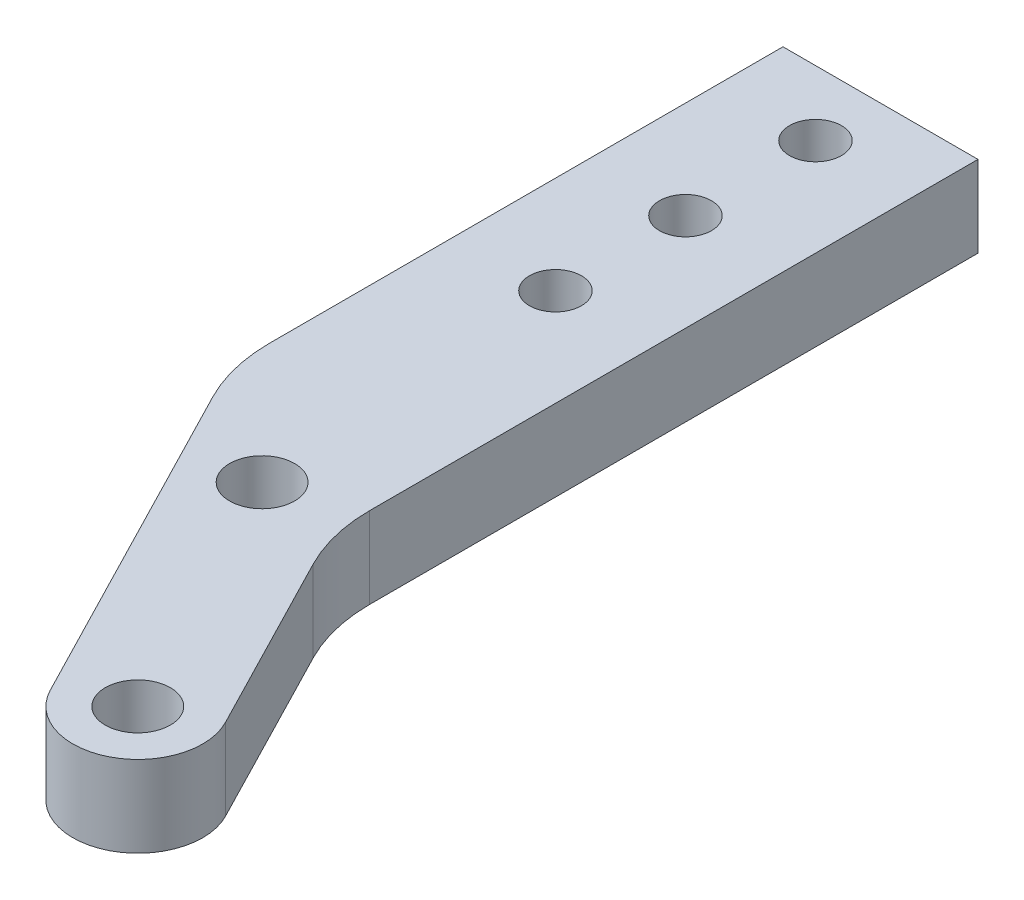
ISO-10303-21;
HEADER;
FILE_DESCRIPTION(('STEP AP214'),'2;1');
FILE_NAME('part.step','',(''),(''),'','','');
FILE_SCHEMA(('AUTOMOTIVE_DESIGN { 1 0 10303 214 1 1 1 1 }'));
ENDSEC;
DATA;
#1=APPLICATION_CONTEXT('core data for automotive mechanical design processes');
#2=APPLICATION_PROTOCOL_DEFINITION('international standard','automotive_design',2000,#1);
#3=PRODUCT_CONTEXT('',#1,'mechanical');
#4=PRODUCT('Part','Part','',(#3));
#5=PRODUCT_RELATED_PRODUCT_CATEGORY('part','',(#4));
#6=PRODUCT_DEFINITION_FORMATION('','',#4);
#7=PRODUCT_DEFINITION_CONTEXT('part definition',#1,'design');
#8=PRODUCT_DEFINITION('design','',#6,#7);
#9=PRODUCT_DEFINITION_SHAPE('','',#8);
#10=(LENGTH_UNIT() NAMED_UNIT(*) SI_UNIT(.MILLI.,.METRE.));
#11=(NAMED_UNIT(*) PLANE_ANGLE_UNIT() SI_UNIT($,.RADIAN.));
#12=(NAMED_UNIT(*) SI_UNIT($,.STERADIAN.) SOLID_ANGLE_UNIT());
#13=UNCERTAINTY_MEASURE_WITH_UNIT(LENGTH_MEASURE(1.E-05),#10,'distance_accuracy_value','');
#14=(GEOMETRIC_REPRESENTATION_CONTEXT(3) GLOBAL_UNCERTAINTY_ASSIGNED_CONTEXT((#13)) GLOBAL_UNIT_ASSIGNED_CONTEXT((#10,
#11,#12)) REPRESENTATION_CONTEXT('',''));
#15=CARTESIAN_POINT('',(0.,0.,0.));
#16=DIRECTION('',(0.,0.,1.));
#17=DIRECTION('',(1.,0.,0.));
#18=AXIS2_PLACEMENT_3D('',#15,#16,#17);
#19=CARTESIAN_POINT('',(4.00000000017351,5.,31.6132614791281));
#20=DIRECTION('',(0.,-1.,0.));
#21=DIRECTION('',(0.,0.,-1.));
#22=AXIS2_PLACEMENT_3D('',#19,#20,#21);
#23=CYLINDRICAL_SURFACE('',#22,10.0000000004375);
#24=CARTESIAN_POINT('',(4.00000000017351,0.,31.6132614791281));
#25=DIRECTION('',(0.,-1.,0.));
#26=DIRECTION('',(0.,0.,-1.));
#27=AXIS2_PLACEMENT_3D('',#24,#25,#26);
#28=CIRCLE('',#27,10.0000000004375);
#29=CARTESIAN_POINT('',(-4.88937213881033,0.,36.1935521886143));
#30=VERTEX_POINT('',#29);
#31=CARTESIAN_POINT('',(-6.00000000026409,0.,31.6132614791279));
#32=VERTEX_POINT('',#31);
#33=EDGE_CURVE('E131',#30,#32,#28,.T.);
#34=ORIENTED_EDGE('',*,*,#33,.F.);
#35=DIRECTION('',(0.,-1.,0.));
#36=VECTOR('',#35,1.);
#37=CARTESIAN_POINT('',(-4.88937213881033,5.,36.1935521886143));
#38=LINE('',#37,#36);
#39=CARTESIAN_POINT('',(-4.88937213881033,5.,36.1935521886143));
#40=VERTEX_POINT('',#39);
#41=EDGE_CURVE('E11',#40,#30,#38,.T.);
#42=ORIENTED_EDGE('',*,*,#41,.F.);
#43=CARTESIAN_POINT('',(4.00000000017351,5.,31.6132614791281));
#44=DIRECTION('',(0.,-1.,0.));
#45=DIRECTION('',(0.,0.,-1.));
#46=AXIS2_PLACEMENT_3D('',#43,#44,#45);
#47=CIRCLE('',#46,10.0000000004375);
#48=CARTESIAN_POINT('',(-6.00000000026409,5.,31.6132614791279));
#49=VERTEX_POINT('',#48);
#50=EDGE_CURVE('E152',#40,#49,#47,.T.);
#51=ORIENTED_EDGE('',*,*,#50,.T.);
#52=DIRECTION('',(0.,-1.,0.));
#53=VECTOR('',#52,1.);
#54=CARTESIAN_POINT('',(-6.00000000026409,5.,31.6132614791279));
#55=LINE('',#54,#53);
#56=EDGE_CURVE('E37',#49,#32,#55,.T.);
#57=ORIENTED_EDGE('',*,*,#56,.T.);
#58=EDGE_LOOP('',(#34,#42,#51,#57));
#59=FACE_BOUND('',#58,.T.);
#60=ADVANCED_FACE('F34',(#59),#23,.T.);
#61=CARTESIAN_POINT('',(5.74474486111336,5.,56.8321162836911));
#62=DIRECTION('',(-0.888937213859502,0.,0.458029070928589));
#63=DIRECTION('',(0.458029070928589,0.,0.888937213859502));
#64=AXIS2_PLACEMENT_3D('',#61,#62,#63);
#65=PLANE('',#64);
#66=DIRECTION('',(-0.458029070928589,0.,-0.888937213859502));
#67=VECTOR('',#66,1.);
#68=CARTESIAN_POINT('',(5.74474486111336,0.,56.8321162836911));
#69=LINE('',#68,#67);
#70=CARTESIAN_POINT('',(5.74474486111336,0.,56.8321162836911));
#71=VERTEX_POINT('',#70);
#72=EDGE_CURVE('E150',#71,#30,#69,.T.);
#73=ORIENTED_EDGE('',*,*,#72,.F.);
#74=DIRECTION('',(0.,-1.,0.));
#75=VECTOR('',#74,1.);
#76=CARTESIAN_POINT('',(5.74474486111336,5.,56.8321162836911));
#77=LINE('',#76,#75);
#78=CARTESIAN_POINT('',(5.74474486111336,5.,56.8321162836911));
#79=VERTEX_POINT('',#78);
#80=EDGE_CURVE('E43',#79,#71,#77,.T.);
#81=ORIENTED_EDGE('',*,*,#80,.F.);
#82=DIRECTION('',(-0.458029070928589,0.,-0.888937213859502));
#83=VECTOR('',#82,1.);
#84=CARTESIAN_POINT('',(5.74474486111336,5.,56.8321162836911));
#85=LINE('',#84,#83);
#86=EDGE_CURVE('E121',#79,#40,#85,.T.);
#87=ORIENTED_EDGE('',*,*,#86,.T.);
#88=ORIENTED_EDGE('',*,*,#41,.T.);
#89=EDGE_LOOP('',(#73,#81,#87,#88));
#90=FACE_BOUND('',#89,.T.);
#91=ADVANCED_FACE('F164',(#90),#65,.T.);
#92=CARTESIAN_POINT('',(9.30049371665921,5.,54.9999999999211));
#93=DIRECTION('',(0.,-1.,0.));
#94=DIRECTION('',(0.,0.,-1.));
#95=AXIS2_PLACEMENT_3D('',#92,#93,#94);
#96=CYLINDRICAL_SURFACE('',#95,4.00000000012132);
#97=CARTESIAN_POINT('',(9.30049371665921,0.,54.9999999999211));
#98=DIRECTION('',(0.,-1.,0.));
#99=DIRECTION('',(0.,0.,-1.));
#100=AXIS2_PLACEMENT_3D('',#97,#98,#99);
#101=CIRCLE('',#100,4.00000000012132);
#102=CARTESIAN_POINT('',(12.8562425722051,0.,53.1678837161512));
#103=VERTEX_POINT('',#102);
#104=EDGE_CURVE('E108',#103,#71,#101,.T.);
#105=ORIENTED_EDGE('',*,*,#104,.F.);
#106=DIRECTION('',(0.,-1.,0.));
#107=VECTOR('',#106,1.);
#108=CARTESIAN_POINT('',(12.8562425722051,5.,53.1678837161512));
#109=LINE('',#108,#107);
#110=CARTESIAN_POINT('',(12.8562425722051,5.,53.1678837161512));
#111=VERTEX_POINT('',#110);
#112=EDGE_CURVE('E103',#111,#103,#109,.T.);
#113=ORIENTED_EDGE('',*,*,#112,.F.);
#114=CARTESIAN_POINT('',(9.30049371665921,5.,54.9999999999211));
#115=DIRECTION('',(0.,-1.,0.));
#116=DIRECTION('',(0.,0.,-1.));
#117=AXIS2_PLACEMENT_3D('',#114,#115,#116);
#118=CIRCLE('',#117,4.00000000012132);
#119=EDGE_CURVE('E106',#111,#79,#118,.T.);
#120=ORIENTED_EDGE('',*,*,#119,.T.);
#121=ORIENTED_EDGE('',*,*,#80,.T.);
#122=EDGE_LOOP('',(#105,#113,#120,#121));
#123=FACE_BOUND('',#122,.T.);
#124=ADVANCED_FACE('F105',(#123),#96,.T.);
#125=CARTESIAN_POINT('',(7.11062786169108,5.,42.0168650213776));
#126=DIRECTION('',(0.888937213859502,0.,-0.458029070928589));
#127=DIRECTION('',(-0.458029070928589,0.,-0.888937213859502));
#128=AXIS2_PLACEMENT_3D('',#125,#126,#127);
#129=PLANE('',#128);
#130=DIRECTION('',(0.458029070928589,0.,0.888937213859502));
#131=VECTOR('',#130,1.);
#132=CARTESIAN_POINT('',(7.11062786169108,0.,42.0168650213776));
#133=LINE('',#132,#131);
#134=CARTESIAN_POINT('',(7.110627861691,0.,42.0168650213777));
#135=VERTEX_POINT('',#134);
#136=EDGE_CURVE('E147',#135,#103,#133,.T.);
#137=ORIENTED_EDGE('',*,*,#136,.F.);
#138=DIRECTION('',(0.,-1.,0.));
#139=VECTOR('',#138,1.);
#140=CARTESIAN_POINT('',(7.110627861691,5.,42.0168650213777));
#141=LINE('',#140,#139);
#142=CARTESIAN_POINT('',(7.110627861691,5.,42.0168650213777));
#143=VERTEX_POINT('',#142);
#144=EDGE_CURVE('E113',#143,#135,#141,.T.);
#145=ORIENTED_EDGE('',*,*,#144,.F.);
#146=DIRECTION('',(0.458029070928589,0.,0.888937213859502));
#147=VECTOR('',#146,1.);
#148=CARTESIAN_POINT('',(7.11062786169108,5.,42.0168650213776));
#149=LINE('',#148,#147);
#150=EDGE_CURVE('E119',#143,#111,#149,.T.);
#151=ORIENTED_EDGE('',*,*,#150,.T.);
#152=ORIENTED_EDGE('',*,*,#112,.T.);
#153=EDGE_LOOP('',(#137,#145,#151,#152));
#154=FACE_BOUND('',#153,.T.);
#155=ADVANCED_FACE('F123',(#154),#129,.T.);
#156=CARTESIAN_POINT('',(16.0000000004639,5.,37.4365743120001));
#157=DIRECTION('',(0.,-1.,0.));
#158=DIRECTION('',(0.,0.,-1.));
#159=AXIS2_PLACEMENT_3D('',#156,#157,#158);
#160=CYLINDRICAL_SURFACE('',#159,10.0000000002001);
#161=CARTESIAN_POINT('',(16.0000000004639,0.,37.4365743120001));
#162=DIRECTION('',(0.,1.,0.));
#163=DIRECTION('',(0.,0.,1.));
#164=AXIS2_PLACEMENT_3D('',#161,#162,#163);
#165=CIRCLE('',#164,10.0000000002001);
#166=CARTESIAN_POINT('',(6.0000000002637,0.,37.436574312));
#167=VERTEX_POINT('',#166);
#168=EDGE_CURVE('E144',#167,#135,#165,.T.);
#169=ORIENTED_EDGE('',*,*,#168,.F.);
#170=DIRECTION('',(0.,-1.,0.));
#171=VECTOR('',#170,1.);
#172=CARTESIAN_POINT('',(6.0000000002637,5.,37.436574312));
#173=LINE('',#172,#171);
#174=CARTESIAN_POINT('',(6.0000000002637,5.,37.436574312));
#175=VERTEX_POINT('',#174);
#176=EDGE_CURVE('E156',#175,#167,#173,.T.);
#177=ORIENTED_EDGE('',*,*,#176,.F.);
#178=CARTESIAN_POINT('',(16.0000000004639,5.,37.4365743120001));
#179=DIRECTION('',(0.,1.,0.));
#180=DIRECTION('',(0.,0.,1.));
#181=AXIS2_PLACEMENT_3D('',#178,#179,#180);
#182=CIRCLE('',#181,10.0000000002001);
#183=EDGE_CURVE('E124',#175,#143,#182,.T.);
#184=ORIENTED_EDGE('',*,*,#183,.T.);
#185=ORIENTED_EDGE('',*,*,#144,.T.);
#186=EDGE_LOOP('',(#169,#177,#184,#185));
#187=FACE_BOUND('',#186,.T.);
#188=ADVANCED_FACE('F177',(#187),#160,.F.);
#189=CARTESIAN_POINT('',(6.00000000026389,5.,0.));
#190=DIRECTION('',(1.,0.,0.));
#191=DIRECTION('',(0.,0.,-1.));
#192=AXIS2_PLACEMENT_3D('',#189,#190,#191);
#193=PLANE('',#192);
#194=DIRECTION('',(0.,0.,1.));
#195=VECTOR('',#194,1.);
#196=CARTESIAN_POINT('',(6.00000000026389,0.,0.));
#197=LINE('',#196,#195);
#198=CARTESIAN_POINT('',(6.00000000026389,0.,0.));
#199=VERTEX_POINT('',#198);
#200=EDGE_CURVE('E141',#199,#167,#197,.T.);
#201=ORIENTED_EDGE('',*,*,#200,.F.);
#202=DIRECTION('',(0.,-1.,0.));
#203=VECTOR('',#202,1.);
#204=CARTESIAN_POINT('',(6.00000000026389,5.,0.));
#205=LINE('',#204,#203);
#206=CARTESIAN_POINT('',(6.00000000026389,5.,0.));
#207=VERTEX_POINT('',#206);
#208=EDGE_CURVE('E158',#207,#199,#205,.T.);
#209=ORIENTED_EDGE('',*,*,#208,.F.);
#210=DIRECTION('',(0.,0.,1.));
#211=VECTOR('',#210,1.);
#212=CARTESIAN_POINT('',(6.00000000026389,5.,0.));
#213=LINE('',#212,#211);
#214=EDGE_CURVE('E126',#207,#175,#213,.T.);
#215=ORIENTED_EDGE('',*,*,#214,.T.);
#216=ORIENTED_EDGE('',*,*,#176,.T.);
#217=EDGE_LOOP('',(#201,#209,#215,#216));
#218=FACE_BOUND('',#217,.T.);
#219=ADVANCED_FACE('F180',(#218),#193,.T.);
#220=CARTESIAN_POINT('',(-6.00000000026389,5.,0.));
#221=DIRECTION('',(0.,0.,-1.));
#222=DIRECTION('',(-1.,0.,0.));
#223=AXIS2_PLACEMENT_3D('',#220,#221,#222);
#224=PLANE('',#223);
#225=DIRECTION('',(1.,0.,0.));
#226=VECTOR('',#225,1.);
#227=CARTESIAN_POINT('',(-6.00000000026389,0.,0.));
#228=LINE('',#227,#226);
#229=CARTESIAN_POINT('',(-6.00000000026389,0.,0.));
#230=VERTEX_POINT('',#229);
#231=EDGE_CURVE('E138',#230,#199,#228,.T.);
#232=ORIENTED_EDGE('',*,*,#231,.F.);
#233=DIRECTION('',(0.,-1.,0.));
#234=VECTOR('',#233,1.);
#235=CARTESIAN_POINT('',(-6.00000000026389,5.,0.));
#236=LINE('',#235,#234);
#237=CARTESIAN_POINT('',(-6.00000000026389,5.,0.));
#238=VERTEX_POINT('',#237);
#239=EDGE_CURVE('E159',#238,#230,#236,.T.);
#240=ORIENTED_EDGE('',*,*,#239,.F.);
#241=DIRECTION('',(1.,0.,0.));
#242=VECTOR('',#241,1.);
#243=CARTESIAN_POINT('',(-6.00000000026389,5.,0.));
#244=LINE('',#243,#242);
#245=EDGE_CURVE('E256',#238,#207,#244,.T.);
#246=ORIENTED_EDGE('',*,*,#245,.T.);
#247=ORIENTED_EDGE('',*,*,#208,.T.);
#248=EDGE_LOOP('',(#232,#240,#246,#247));
#249=FACE_BOUND('',#248,.T.);
#250=ADVANCED_FACE('F184',(#249),#224,.T.);
#251=CARTESIAN_POINT('',(-6.00000000026409,5.,31.6132614791279));
#252=DIRECTION('',(-1.,0.,0.));
#253=DIRECTION('',(0.,0.,1.));
#254=AXIS2_PLACEMENT_3D('',#251,#252,#253);
#255=PLANE('',#254);
#256=DIRECTION('',(0.,0.,-1.));
#257=VECTOR('',#256,1.);
#258=CARTESIAN_POINT('',(-6.00000000026409,0.,31.6132614791279));
#259=LINE('',#258,#257);
#260=EDGE_CURVE('E134',#32,#230,#259,.T.);
#261=ORIENTED_EDGE('',*,*,#260,.F.);
#262=ORIENTED_EDGE('',*,*,#56,.F.);
#263=DIRECTION('',(0.,0.,-1.));
#264=VECTOR('',#263,1.);
#265=CARTESIAN_POINT('',(-6.00000000026409,5.,31.6132614791279));
#266=LINE('',#265,#264);
#267=EDGE_CURVE('E254',#49,#238,#266,.T.);
#268=ORIENTED_EDGE('',*,*,#267,.T.);
#269=ORIENTED_EDGE('',*,*,#239,.T.);
#270=EDGE_LOOP('',(#261,#262,#268,#269));
#271=FACE_BOUND('',#270,.T.);
#272=ADVANCED_FACE('F161',(#271),#255,.T.);
#273=CARTESIAN_POINT('',(4.00000000017351,5.,31.6132614791281));
#274=DIRECTION('',(0.,-1.,0.));
#275=DIRECTION('',(0.,0.,-1.));
#276=AXIS2_PLACEMENT_3D('',#273,#274,#275);
#277=PLANE('',#276);
#278=CARTESIAN_POINT('',(9.3,5.,55.0000000000424));
#279=DIRECTION('',(0.,-1.,0.));
#280=DIRECTION('',(0.,0.,-1.));
#281=AXIS2_PLACEMENT_3D('',#278,#279,#280);
#282=CIRCLE('',#281,2.);
#283=CARTESIAN_POINT('',(9.3,5.,53.0000000000424));
#284=VERTEX_POINT('',#283);
#285=EDGE_CURVE('E223',#284,#284,#282,.T.);
#286=ORIENTED_EDGE('',*,*,#285,.T.);
#287=EDGE_LOOP('',(#286));
#288=FACE_BOUND('',#287,.T.);
#289=CARTESIAN_POINT('',(1.18087919,5.,39.2314574400424));
#290=DIRECTION('',(0.,-1.,0.));
#291=DIRECTION('',(0.,0.,-1.));
#292=AXIS2_PLACEMENT_3D('',#289,#290,#291);
#293=CIRCLE('',#292,2.);
#294=CARTESIAN_POINT('',(1.18087919,5.,37.2314574400424));
#295=VERTEX_POINT('',#294);
#296=EDGE_CURVE('E233',#295,#295,#293,.T.);
#297=ORIENTED_EDGE('',*,*,#296,.T.);
#298=EDGE_LOOP('',(#297));
#299=FACE_BOUND('',#298,.T.);
#300=CARTESIAN_POINT('',(0.,5.,20.));
#301=DIRECTION('',(0.,-1.,0.));
#302=DIRECTION('',(0.,0.,-1.));
#303=AXIS2_PLACEMENT_3D('',#300,#301,#302);
#304=CIRCLE('',#303,1.5999968);
#305=CARTESIAN_POINT('',(0.,5.,18.4000032));
#306=VERTEX_POINT('',#305);
#307=EDGE_CURVE('E239',#306,#306,#304,.T.);
#308=ORIENTED_EDGE('',*,*,#307,.T.);
#309=EDGE_LOOP('',(#308));
#310=FACE_BOUND('',#309,.T.);
#311=CARTESIAN_POINT('',(0.,5.,12.));
#312=DIRECTION('',(0.,-1.,0.));
#313=DIRECTION('',(0.,0.,-1.));
#314=AXIS2_PLACEMENT_3D('',#311,#312,#313);
#315=CIRCLE('',#314,1.5999968);
#316=CARTESIAN_POINT('',(0.,5.,10.4000032));
#317=VERTEX_POINT('',#316);
#318=EDGE_CURVE('E245',#317,#317,#315,.T.);
#319=ORIENTED_EDGE('',*,*,#318,.T.);
#320=EDGE_LOOP('',(#319));
#321=FACE_BOUND('',#320,.T.);
#322=CARTESIAN_POINT('',(0.,5.,3.99999999999996));
#323=DIRECTION('',(0.,-1.,0.));
#324=DIRECTION('',(0.,0.,-1.));
#325=AXIS2_PLACEMENT_3D('',#322,#323,#324);
#326=CIRCLE('',#325,1.5999968);
#327=CARTESIAN_POINT('',(0.,5.,2.40000319999996));
#328=VERTEX_POINT('',#327);
#329=EDGE_CURVE('E135',#328,#328,#326,.T.);
#330=ORIENTED_EDGE('',*,*,#329,.T.);
#331=EDGE_LOOP('',(#330));
#332=FACE_BOUND('',#331,.T.);
#333=ORIENTED_EDGE('',*,*,#50,.F.);
#334=ORIENTED_EDGE('',*,*,#86,.F.);
#335=ORIENTED_EDGE('',*,*,#119,.F.);
#336=ORIENTED_EDGE('',*,*,#150,.F.);
#337=ORIENTED_EDGE('',*,*,#183,.F.);
#338=ORIENTED_EDGE('',*,*,#214,.F.);
#339=ORIENTED_EDGE('',*,*,#245,.F.);
#340=ORIENTED_EDGE('',*,*,#267,.F.);
#341=EDGE_LOOP('',(#333,#334,#335,#336,#337,#338,#339,#340));
#342=FACE_BOUND('',#341,.T.);
#343=ADVANCED_FACE('F117',(#288,#299,#310,#321,#332,#342),#277,.F.);
#344=CARTESIAN_POINT('',(4.00000000017351,0.,31.6132614791281));
#345=DIRECTION('',(0.,-1.,0.));
#346=DIRECTION('',(0.,0.,-1.));
#347=AXIS2_PLACEMENT_3D('',#344,#345,#346);
#348=PLANE('',#347);
#349=CARTESIAN_POINT('',(9.3,0.,55.0000000000424));
#350=DIRECTION('',(0.,-1.,0.));
#351=DIRECTION('',(0.,0.,-1.));
#352=AXIS2_PLACEMENT_3D('',#349,#350,#351);
#353=CIRCLE('',#352,2.);
#354=CARTESIAN_POINT('',(9.3,0.,53.0000000000424));
#355=VERTEX_POINT('',#354);
#356=EDGE_CURVE('E226',#355,#355,#353,.T.);
#357=ORIENTED_EDGE('',*,*,#356,.F.);
#358=EDGE_LOOP('',(#357));
#359=FACE_BOUND('',#358,.T.);
#360=CARTESIAN_POINT('',(1.18087919,0.,39.2314574400424));
#361=DIRECTION('',(0.,-1.,0.));
#362=DIRECTION('',(0.,0.,-1.));
#363=AXIS2_PLACEMENT_3D('',#360,#361,#362);
#364=CIRCLE('',#363,2.);
#365=CARTESIAN_POINT('',(1.18087919,0.,37.2314574400424));
#366=VERTEX_POINT('',#365);
#367=EDGE_CURVE('E228',#366,#366,#364,.T.);
#368=ORIENTED_EDGE('',*,*,#367,.F.);
#369=EDGE_LOOP('',(#368));
#370=FACE_BOUND('',#369,.T.);
#371=CARTESIAN_POINT('',(0.,0.,20.));
#372=DIRECTION('',(0.,-1.,0.));
#373=DIRECTION('',(0.,0.,-1.));
#374=AXIS2_PLACEMENT_3D('',#371,#372,#373);
#375=CIRCLE('',#374,1.59999679999999);
#376=CARTESIAN_POINT('',(0.,0.,18.4000032));
#377=VERTEX_POINT('',#376);
#378=EDGE_CURVE('E236',#377,#377,#375,.T.);
#379=ORIENTED_EDGE('',*,*,#378,.F.);
#380=EDGE_LOOP('',(#379));
#381=FACE_BOUND('',#380,.T.);
#382=CARTESIAN_POINT('',(0.,0.,12.));
#383=DIRECTION('',(0.,-1.,0.));
#384=DIRECTION('',(0.,0.,-1.));
#385=AXIS2_PLACEMENT_3D('',#382,#383,#384);
#386=CIRCLE('',#385,1.59999679999999);
#387=CARTESIAN_POINT('',(0.,0.,10.4000032));
#388=VERTEX_POINT('',#387);
#389=EDGE_CURVE('E242',#388,#388,#386,.T.);
#390=ORIENTED_EDGE('',*,*,#389,.F.);
#391=EDGE_LOOP('',(#390));
#392=FACE_BOUND('',#391,.T.);
#393=CARTESIAN_POINT('',(0.,0.,3.99999999999996));
#394=DIRECTION('',(0.,-1.,0.));
#395=DIRECTION('',(0.,0.,-1.));
#396=AXIS2_PLACEMENT_3D('',#393,#394,#395);
#397=CIRCLE('',#396,1.59999679999999);
#398=CARTESIAN_POINT('',(0.,0.,2.40000319999997));
#399=VERTEX_POINT('',#398);
#400=EDGE_CURVE('E248',#399,#399,#397,.T.);
#401=ORIENTED_EDGE('',*,*,#400,.F.);
#402=EDGE_LOOP('',(#401));
#403=FACE_BOUND('',#402,.T.);
#404=ORIENTED_EDGE('',*,*,#33,.T.);
#405=ORIENTED_EDGE('',*,*,#260,.T.);
#406=ORIENTED_EDGE('',*,*,#231,.T.);
#407=ORIENTED_EDGE('',*,*,#200,.T.);
#408=ORIENTED_EDGE('',*,*,#168,.T.);
#409=ORIENTED_EDGE('',*,*,#136,.T.);
#410=ORIENTED_EDGE('',*,*,#104,.T.);
#411=ORIENTED_EDGE('',*,*,#72,.T.);
#412=EDGE_LOOP('',(#404,#405,#406,#407,#408,#409,#410,#411));
#413=FACE_BOUND('',#412,.T.);
#414=ADVANCED_FACE('F163',(#359,#370,#381,#392,#403,#413),#348,.T.);
#415=CARTESIAN_POINT('',(0.,0.,3.99999999999996));
#416=DIRECTION('',(0.,-1.,0.));
#417=DIRECTION('',(0.,0.,-1.));
#418=AXIS2_PLACEMENT_3D('',#415,#416,#417);
#419=CYLINDRICAL_SURFACE('',#418,1.59999679999999);
#420=ORIENTED_EDGE('',*,*,#329,.F.);
#421=EDGE_LOOP('',(#420));
#422=FACE_BOUND('',#421,.T.);
#423=ORIENTED_EDGE('',*,*,#400,.T.);
#424=EDGE_LOOP('',(#423));
#425=FACE_BOUND('',#424,.T.);
#426=ADVANCED_FACE('F196',(#422,#425),#419,.F.);
#427=CARTESIAN_POINT('',(0.,0.,12.));
#428=DIRECTION('',(0.,-1.,0.));
#429=DIRECTION('',(0.,0.,-1.));
#430=AXIS2_PLACEMENT_3D('',#427,#428,#429);
#431=CYLINDRICAL_SURFACE('',#430,1.59999679999999);
#432=ORIENTED_EDGE('',*,*,#318,.F.);
#433=EDGE_LOOP('',(#432));
#434=FACE_BOUND('',#433,.T.);
#435=ORIENTED_EDGE('',*,*,#389,.T.);
#436=EDGE_LOOP('',(#435));
#437=FACE_BOUND('',#436,.T.);
#438=ADVANCED_FACE('F203',(#434,#437),#431,.F.);
#439=CARTESIAN_POINT('',(0.,0.,20.));
#440=DIRECTION('',(0.,-1.,0.));
#441=DIRECTION('',(0.,0.,-1.));
#442=AXIS2_PLACEMENT_3D('',#439,#440,#441);
#443=CYLINDRICAL_SURFACE('',#442,1.59999679999999);
#444=ORIENTED_EDGE('',*,*,#307,.F.);
#445=EDGE_LOOP('',(#444));
#446=FACE_BOUND('',#445,.T.);
#447=ORIENTED_EDGE('',*,*,#378,.T.);
#448=EDGE_LOOP('',(#447));
#449=FACE_BOUND('',#448,.T.);
#450=ADVANCED_FACE('F207',(#446,#449),#443,.F.);
#451=CARTESIAN_POINT('',(1.18087919,0.,39.2314574400424));
#452=DIRECTION('',(0.,-1.,0.));
#453=DIRECTION('',(0.,0.,-1.));
#454=AXIS2_PLACEMENT_3D('',#451,#452,#453);
#455=CYLINDRICAL_SURFACE('',#454,2.);
#456=ORIENTED_EDGE('',*,*,#296,.F.);
#457=EDGE_LOOP('',(#456));
#458=FACE_BOUND('',#457,.T.);
#459=ORIENTED_EDGE('',*,*,#367,.T.);
#460=EDGE_LOOP('',(#459));
#461=FACE_BOUND('',#460,.T.);
#462=ADVANCED_FACE('F211',(#458,#461),#455,.F.);
#463=CARTESIAN_POINT('',(9.3,0.,55.0000000000424));
#464=DIRECTION('',(0.,-1.,0.));
#465=DIRECTION('',(0.,0.,-1.));
#466=AXIS2_PLACEMENT_3D('',#463,#464,#465);
#467=CYLINDRICAL_SURFACE('',#466,2.);
#468=ORIENTED_EDGE('',*,*,#285,.F.);
#469=EDGE_LOOP('',(#468));
#470=FACE_BOUND('',#469,.T.);
#471=ORIENTED_EDGE('',*,*,#356,.T.);
#472=EDGE_LOOP('',(#471));
#473=FACE_BOUND('',#472,.T.);
#474=ADVANCED_FACE('F215',(#470,#473),#467,.F.);
#475=CLOSED_SHELL('',(#60,#91,#124,#155,#188,#219,#250,#272,#343,#414,#426,#438,#450,#462,#474));
#476=MANIFOLD_SOLID_BREP('B2',#475);
#477=ADVANCED_BREP_SHAPE_REPRESENTATION('',(#18,#476),#14);
#478=SHAPE_DEFINITION_REPRESENTATION(#9,#477);
ENDSEC;
END-ISO-10303-21;
